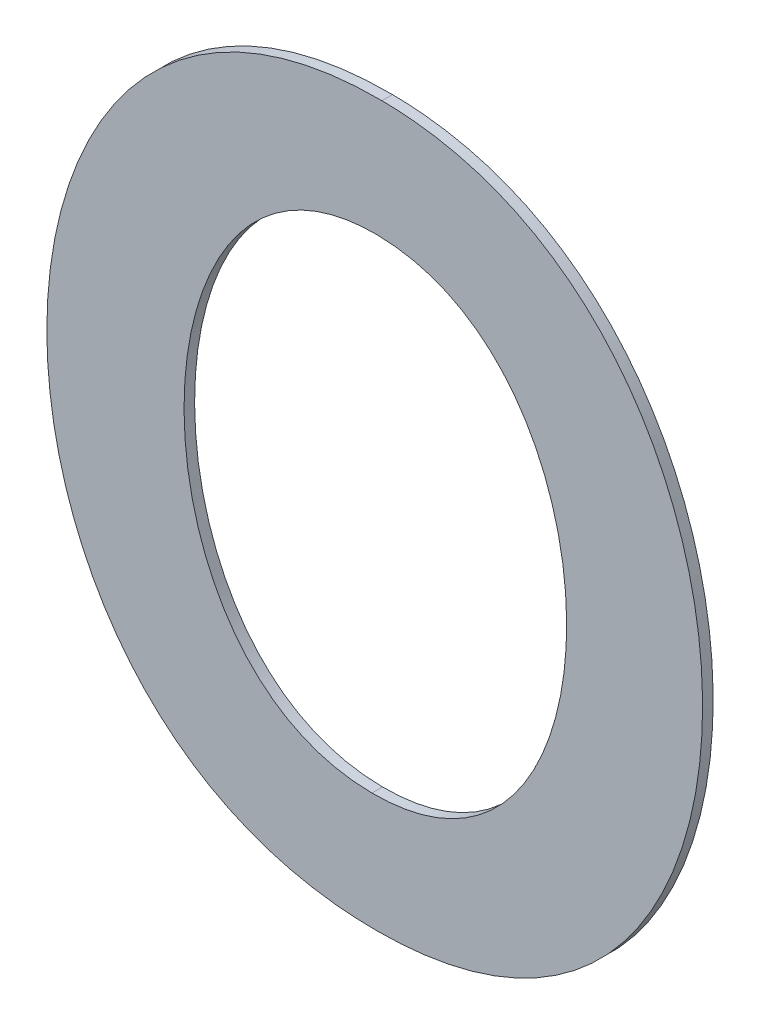
ISO-10303-21;
HEADER;
FILE_DESCRIPTION(('STEP AP214'),'2;1');
FILE_NAME('part.step','',(''),(''),'','','');
FILE_SCHEMA(('AUTOMOTIVE_DESIGN { 1 0 10303 214 1 1 1 1 }'));
ENDSEC;
DATA;
#1=APPLICATION_CONTEXT('core data for automotive mechanical design processes');
#2=APPLICATION_PROTOCOL_DEFINITION('international standard','automotive_design',2000,#1);
#3=PRODUCT_CONTEXT('',#1,'mechanical');
#4=PRODUCT('Part','Part','',(#3));
#5=PRODUCT_RELATED_PRODUCT_CATEGORY('part','',(#4));
#6=PRODUCT_DEFINITION_FORMATION('','',#4);
#7=PRODUCT_DEFINITION_CONTEXT('part definition',#1,'design');
#8=PRODUCT_DEFINITION('design','',#6,#7);
#9=PRODUCT_DEFINITION_SHAPE('','',#8);
#10=(LENGTH_UNIT() NAMED_UNIT(*) SI_UNIT(.MILLI.,.METRE.));
#11=(NAMED_UNIT(*) PLANE_ANGLE_UNIT() SI_UNIT($,.RADIAN.));
#12=(NAMED_UNIT(*) SI_UNIT($,.STERADIAN.) SOLID_ANGLE_UNIT());
#13=UNCERTAINTY_MEASURE_WITH_UNIT(LENGTH_MEASURE(1.E-05),#10,'distance_accuracy_value','');
#14=(GEOMETRIC_REPRESENTATION_CONTEXT(3) GLOBAL_UNCERTAINTY_ASSIGNED_CONTEXT((#13)) GLOBAL_UNIT_ASSIGNED_CONTEXT((#10,
#11,#12)) REPRESENTATION_CONTEXT('',''));
#15=CARTESIAN_POINT('',(0.,0.,0.));
#16=DIRECTION('',(0.,0.,1.));
#17=DIRECTION('',(1.,0.,0.));
#18=AXIS2_PLACEMENT_3D('',#15,#16,#17);
#19=CARTESIAN_POINT('',(3.6399052508912,-0.509342481978461,0.));
#20=CARTESIAN_POINT('',(3.6399052508912,-0.509342481978461,0.003));
#21=CARTESIAN_POINT('',(3.712021161188,-0.510282177013797,0.));
#22=CARTESIAN_POINT('',(3.712021161188,-0.510282177013797,0.003));
#23=CARTESIAN_POINT('',(3.712021161188,-0.647895399613491,0.));
#24=CARTESIAN_POINT('',(3.712021161188,-0.647895399613491,0.003));
#25=CARTESIAN_POINT('',(3.6384843410598,-0.647436919374479,0.));
#26=CARTESIAN_POINT('',(3.6384843410598,-0.647436919374479,0.003));
#27=B_SPLINE_SURFACE_WITH_KNOTS('',3,1,((#19,#20),(#21,#22),(#23,#24),(#25,#26)),.UNSPECIFIED.,
.F.,.F.,.F.,(4,4),(2,2),(0.,1.),(0.,0.0003),.UNSPECIFIED.);
#28=CARTESIAN_POINT('',(3.6399052508912,-0.509342481978461,0.));
#29=CARTESIAN_POINT('',(3.712021161188,-0.510282177013797,0.));
#30=CARTESIAN_POINT('',(3.712021161188,-0.647895399613491,0.));
#31=CARTESIAN_POINT('',(3.6384843410598,-0.647436919374479,0.));
#32=B_SPLINE_CURVE_WITH_KNOTS('',3,(#28,#29,#30,#31),.UNSPECIFIED.,.F.,.F.,(4,4),(0.,1.),.UNSPECIFIED.);
#33=CARTESIAN_POINT('',(3.6399052508912,-0.509342481978461,0.));
#34=VERTEX_POINT('',#33);
#35=CARTESIAN_POINT('',(3.6384843410598,-0.647436919374479,0.));
#36=VERTEX_POINT('',#35);
#37=EDGE_CURVE('E11',#34,#36,#32,.T.);
#38=DIRECTION('',(0.,0.,1.));
#39=VECTOR('',#38,1.);
#40=CARTESIAN_POINT('',(3.6384843410598,-0.647436919374479,0.));
#41=LINE('',#40,#39);
#42=CARTESIAN_POINT('',(3.6384843410598,-0.647436919374479,0.003));
#43=VERTEX_POINT('',#42);
#44=EDGE_CURVE('E28',#36,#43,#41,.T.);
#45=CARTESIAN_POINT('',(3.6399052508912,-0.509342481978461,0.003));
#46=CARTESIAN_POINT('',(3.712021161188,-0.510282177013797,0.003));
#47=CARTESIAN_POINT('',(3.712021161188,-0.647895399613491,0.003));
#48=CARTESIAN_POINT('',(3.6384843410598,-0.647436919374479,0.003));
#49=B_SPLINE_CURVE_WITH_KNOTS('',3,(#45,#46,#47,#48),.UNSPECIFIED.,.F.,.F.,(4,4),(0.,1.),.UNSPECIFIED.);
#50=CARTESIAN_POINT('',(3.6399052508912,-0.509342481978461,0.003));
#51=VERTEX_POINT('',#50);
#52=EDGE_CURVE('E121',#51,#43,#49,.T.);
#53=DIRECTION('',(0.,0.,1.));
#54=VECTOR('',#53,1.);
#55=CARTESIAN_POINT('',(3.6399052508912,-0.509342481978461,0.));
#56=LINE('',#55,#54);
#57=EDGE_CURVE('E115',#34,#51,#56,.T.);
#58=ORIENTED_EDGE('',*,*,#37,.T.);
#59=ORIENTED_EDGE('',*,*,#44,.T.);
#60=ORIENTED_EDGE('',*,*,#52,.F.);
#61=ORIENTED_EDGE('',*,*,#57,.F.);
#62=EDGE_LOOP('',(#58,#59,#60,#61));
#63=FACE_BOUND('',#62,.T.);
#64=ADVANCED_FACE('F17',(#63),#27,.T.);
#65=CARTESIAN_POINT('',(3.6384843410598,-0.647436919374479,0.));
#66=CARTESIAN_POINT('',(3.6384843410598,-0.647436919374479,0.003));
#67=CARTESIAN_POINT('',(3.5658758486887,-0.64695570457832,0.));
#68=CARTESIAN_POINT('',(3.5658758486887,-0.64695570457832,0.003));
#69=CARTESIAN_POINT('',(3.5682629772049,-0.508861267182275,0.));
#70=CARTESIAN_POINT('',(3.5682629772049,-0.508861267182275,0.003));
#71=CARTESIAN_POINT('',(3.6399052508912,-0.509342481978461,0.));
#72=CARTESIAN_POINT('',(3.6399052508912,-0.509342481978461,0.003));
#73=B_SPLINE_SURFACE_WITH_KNOTS('',3,1,((#65,#66),(#67,#68),(#69,#70),(#71,#72)),.UNSPECIFIED.,
.F.,.F.,.F.,(4,4),(2,2),(0.,1.),(0.,0.0003),.UNSPECIFIED.);
#74=CARTESIAN_POINT('',(3.6384843410598,-0.647436919374479,0.));
#75=CARTESIAN_POINT('',(3.5658758486887,-0.64695570457832,0.));
#76=CARTESIAN_POINT('',(3.5682629772049,-0.508861267182275,0.));
#77=CARTESIAN_POINT('',(3.6399052508912,-0.509342481978461,0.));
#78=B_SPLINE_CURVE_WITH_KNOTS('',3,(#74,#75,#76,#77),.UNSPECIFIED.,.F.,.F.,(4,4),(0.,1.),.UNSPECIFIED.);
#79=EDGE_CURVE('E107',#36,#34,#78,.T.);
#80=CARTESIAN_POINT('',(3.6384843410598,-0.647436919374479,0.003));
#81=CARTESIAN_POINT('',(3.5658758486887,-0.64695570457832,0.003));
#82=CARTESIAN_POINT('',(3.5682629772049,-0.508861267182275,0.003));
#83=CARTESIAN_POINT('',(3.6399052508912,-0.509342481978461,0.003));
#84=B_SPLINE_CURVE_WITH_KNOTS('',3,(#80,#81,#82,#83),.UNSPECIFIED.,.F.,.F.,(4,4),(0.,1.),.UNSPECIFIED.);
#85=EDGE_CURVE('E99',#43,#51,#84,.T.);
#86=ORIENTED_EDGE('',*,*,#79,.T.);
#87=ORIENTED_EDGE('',*,*,#57,.T.);
#88=ORIENTED_EDGE('',*,*,#85,.F.);
#89=ORIENTED_EDGE('',*,*,#44,.F.);
#90=EDGE_LOOP('',(#86,#87,#88,#89));
#91=FACE_BOUND('',#90,.T.);
#92=ADVANCED_FACE('F130',(#91),#73,.T.);
#93=CARTESIAN_POINT('',(3.6399052508912,-0.680639793035438,0.));
#94=CARTESIAN_POINT('',(3.6399052508912,-0.680639793035438,0.003));
#95=CARTESIAN_POINT('',(3.764708497726,-0.680639793035546,0.));
#96=CARTESIAN_POINT('',(3.764708497726,-0.680639793035546,0.003));
#97=CARTESIAN_POINT('',(3.7613835687218,-0.476598088556348,0.));
#98=CARTESIAN_POINT('',(3.7613835687218,-0.476598088556348,0.003));
#99=CARTESIAN_POINT('',(3.641326160722,-0.475658393521528,0.));
#100=CARTESIAN_POINT('',(3.641326160722,-0.475658393521528,0.003));
#101=B_SPLINE_SURFACE_WITH_KNOTS('',3,1,((#93,#94),(#95,#96),(#97,#98),(#99,#100)),
.UNSPECIFIED.,.F.,.F.,.F.,(4,4),(2,2),(0.,1.),(0.,0.0003),.UNSPECIFIED.);
#102=CARTESIAN_POINT('',(3.6399052508912,-0.680639793035438,0.));
#103=CARTESIAN_POINT('',(3.764708497726,-0.680639793035546,0.));
#104=CARTESIAN_POINT('',(3.7613835687218,-0.476598088556348,0.));
#105=CARTESIAN_POINT('',(3.641326160722,-0.475658393521528,0.));
#106=B_SPLINE_CURVE_WITH_KNOTS('',3,(#102,#103,#104,#105),.UNSPECIFIED.,.F.,.F.,(4,4),(0.,1.),.UNSPECIFIED.);
#107=CARTESIAN_POINT('',(3.6399052508912,-0.680639793035438,0.));
#108=VERTEX_POINT('',#107);
#109=CARTESIAN_POINT('',(3.641326160722,-0.475658393521528,0.));
#110=VERTEX_POINT('',#109);
#111=EDGE_CURVE('E95',#108,#110,#106,.T.);
#112=DIRECTION('',(0.,0.,1.));
#113=VECTOR('',#112,1.);
#114=CARTESIAN_POINT('',(3.641326160722,-0.475658393521528,0.));
#115=LINE('',#114,#113);
#116=CARTESIAN_POINT('',(3.641326160722,-0.475658393521528,0.003));
#117=VERTEX_POINT('',#116);
#118=EDGE_CURVE('E63',#110,#117,#115,.T.);
#119=CARTESIAN_POINT('',(3.6399052508912,-0.680639793035438,0.003));
#120=CARTESIAN_POINT('',(3.764708497726,-0.680639793035546,0.003));
#121=CARTESIAN_POINT('',(3.7613835687218,-0.476598088556348,0.003));
#122=CARTESIAN_POINT('',(3.641326160722,-0.475658393521528,0.003));
#123=B_SPLINE_CURVE_WITH_KNOTS('',3,(#119,#120,#121,#122),.UNSPECIFIED.,.F.,.F.,(4,4),(0.,1.),.UNSPECIFIED.);
#124=CARTESIAN_POINT('',(3.6399052508912,-0.680639793035438,0.003));
#125=VERTEX_POINT('',#124);
#126=EDGE_CURVE('E57',#125,#117,#123,.T.);
#127=DIRECTION('',(0.,0.,1.));
#128=VECTOR('',#127,1.);
#129=CARTESIAN_POINT('',(3.6399052508912,-0.680639793035438,0.));
#130=LINE('',#129,#128);
#131=EDGE_CURVE('E60',#108,#125,#130,.T.);
#132=ORIENTED_EDGE('',*,*,#111,.T.);
#133=ORIENTED_EDGE('',*,*,#118,.T.);
#134=ORIENTED_EDGE('',*,*,#126,.F.);
#135=ORIENTED_EDGE('',*,*,#131,.F.);
#136=EDGE_LOOP('',(#132,#133,#134,#135));
#137=FACE_BOUND('',#136,.T.);
#138=ADVANCED_FACE('F59',(#137),#101,.T.);
#139=CARTESIAN_POINT('',(3.641326160722,-0.475658393521528,0.));
#140=CARTESIAN_POINT('',(3.641326160722,-0.475658393521528,0.003));
#141=CARTESIAN_POINT('',(3.5170154959616,-0.474696911202375,0.));
#142=CARTESIAN_POINT('',(3.5170154959616,-0.474696911202375,0.003));
#143=CARTESIAN_POINT('',(3.512250711661,-0.680639793035545,0.));
#144=CARTESIAN_POINT('',(3.512250711661,-0.680639793035545,0.003));
#145=CARTESIAN_POINT('',(3.6399052508912,-0.680639793035438,0.));
#146=CARTESIAN_POINT('',(3.6399052508912,-0.680639793035438,0.003));
#147=B_SPLINE_SURFACE_WITH_KNOTS('',3,1,((#139,#140),(#141,#142),(#143,#144),(#145,#146)),
.UNSPECIFIED.,.F.,.F.,.F.,(4,4),(2,2),(0.,1.),(0.,0.0003),.UNSPECIFIED.);
#148=CARTESIAN_POINT('',(3.641326160722,-0.475658393521528,0.));
#149=CARTESIAN_POINT('',(3.5170154959616,-0.474696911202375,0.));
#150=CARTESIAN_POINT('',(3.512250711661,-0.680639793035545,0.));
#151=CARTESIAN_POINT('',(3.6399052508912,-0.680639793035438,0.));
#152=B_SPLINE_CURVE_WITH_KNOTS('',3,(#148,#149,#150,#151),.UNSPECIFIED.,.F.,.F.,(4,4),(0.,1.),.UNSPECIFIED.);
#153=EDGE_CURVE('E72',#110,#108,#152,.T.);
#154=CARTESIAN_POINT('',(3.641326160722,-0.475658393521528,0.003));
#155=CARTESIAN_POINT('',(3.5170154959616,-0.474696911202375,0.003));
#156=CARTESIAN_POINT('',(3.512250711661,-0.680639793035545,0.003));
#157=CARTESIAN_POINT('',(3.6399052508912,-0.680639793035438,0.003));
#158=B_SPLINE_CURVE_WITH_KNOTS('',3,(#154,#155,#156,#157),.UNSPECIFIED.,.F.,.F.,(4,4),(0.,1.),.UNSPECIFIED.);
#159=EDGE_CURVE('E70',#117,#125,#158,.T.);
#160=ORIENTED_EDGE('',*,*,#153,.T.);
#161=ORIENTED_EDGE('',*,*,#131,.T.);
#162=ORIENTED_EDGE('',*,*,#159,.F.);
#163=ORIENTED_EDGE('',*,*,#118,.F.);
#164=EDGE_LOOP('',(#160,#161,#162,#163));
#165=FACE_BOUND('',#164,.T.);
#166=ADVANCED_FACE('F69',(#165),#147,.T.);
#167=CARTESIAN_POINT('',(3.6384796046935,-0.57766835211896,0.003));
#168=DIRECTION('',(0.,0.,1.));
#169=DIRECTION('',(1.,0.,0.));
#170=AXIS2_PLACEMENT_3D('',#167,#168,#169);
#171=PLANE('',#170);
#172=ORIENTED_EDGE('',*,*,#159,.T.);
#173=ORIENTED_EDGE('',*,*,#126,.T.);
#174=EDGE_LOOP('',(#172,#173));
#175=FACE_BOUND('',#174,.T.);
#176=ORIENTED_EDGE('',*,*,#85,.T.);
#177=ORIENTED_EDGE('',*,*,#52,.T.);
#178=EDGE_LOOP('',(#176,#177));
#179=FACE_BOUND('',#178,.T.);
#180=ADVANCED_FACE('F74',(#175,#179),#171,.T.);
#181=CARTESIAN_POINT('',(3.6384796046935,-0.57766835211896,0.));
#182=DIRECTION('',(0.,0.,1.));
#183=DIRECTION('',(1.,0.,0.));
#184=AXIS2_PLACEMENT_3D('',#181,#182,#183);
#185=PLANE('',#184);
#186=ORIENTED_EDGE('',*,*,#153,.F.);
#187=ORIENTED_EDGE('',*,*,#111,.F.);
#188=EDGE_LOOP('',(#186,#187));
#189=FACE_BOUND('',#188,.T.);
#190=ORIENTED_EDGE('',*,*,#79,.F.);
#191=ORIENTED_EDGE('',*,*,#37,.F.);
#192=EDGE_LOOP('',(#190,#191));
#193=FACE_BOUND('',#192,.T.);
#194=ADVANCED_FACE('F131',(#189,#193),#185,.F.);
#195=CLOSED_SHELL('',(#64,#92,#138,#166,#180,#194));
#196=MANIFOLD_SOLID_BREP('B1',#195);
#197=ADVANCED_BREP_SHAPE_REPRESENTATION('',(#18,#196),#14);
#198=SHAPE_DEFINITION_REPRESENTATION(#9,#197);
ENDSEC;
END-ISO-10303-21;
